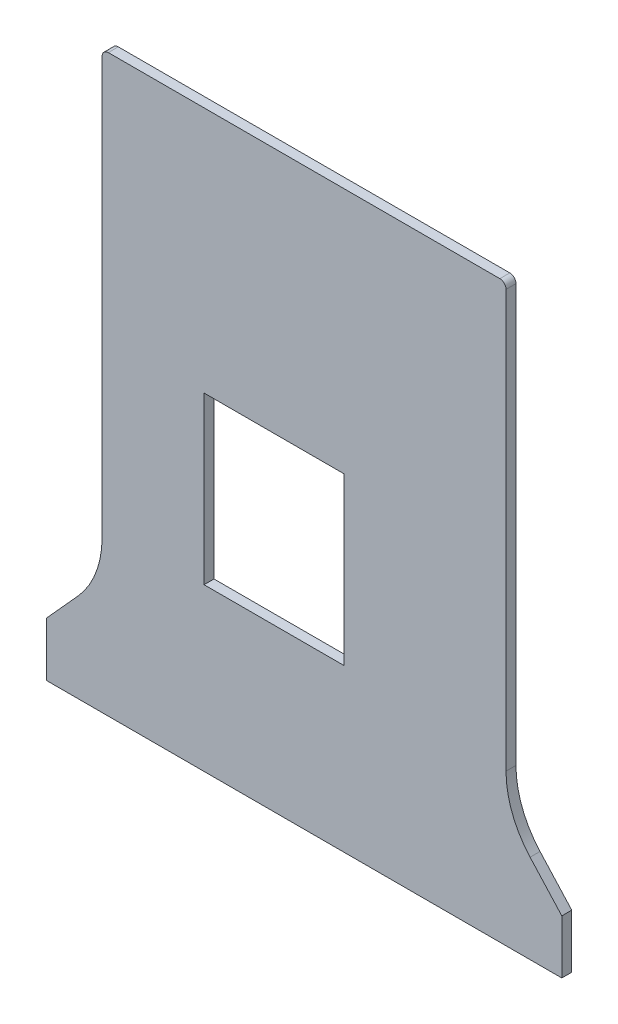
ISO-10303-21;
HEADER;
FILE_DESCRIPTION(('STEP AP214'),'2;1');
FILE_NAME('part.step','',(''),(''),'','','');
FILE_SCHEMA(('AUTOMOTIVE_DESIGN { 1 0 10303 214 1 1 1 1 }'));
ENDSEC;
DATA;
#1=APPLICATION_CONTEXT('core data for automotive mechanical design processes');
#2=APPLICATION_PROTOCOL_DEFINITION('international standard','automotive_design',2000,#1);
#3=PRODUCT_CONTEXT('',#1,'mechanical');
#4=PRODUCT('Part','Part','',(#3));
#5=PRODUCT_RELATED_PRODUCT_CATEGORY('part','',(#4));
#6=PRODUCT_DEFINITION_FORMATION('','',#4);
#7=PRODUCT_DEFINITION_CONTEXT('part definition',#1,'design');
#8=PRODUCT_DEFINITION('design','',#6,#7);
#9=PRODUCT_DEFINITION_SHAPE('','',#8);
#10=(LENGTH_UNIT() NAMED_UNIT(*) SI_UNIT(.MILLI.,.METRE.));
#11=(NAMED_UNIT(*) PLANE_ANGLE_UNIT() SI_UNIT($,.RADIAN.));
#12=(NAMED_UNIT(*) SI_UNIT($,.STERADIAN.) SOLID_ANGLE_UNIT());
#13=UNCERTAINTY_MEASURE_WITH_UNIT(LENGTH_MEASURE(1.E-05),#10,'distance_accuracy_value','');
#14=(GEOMETRIC_REPRESENTATION_CONTEXT(3) GLOBAL_UNCERTAINTY_ASSIGNED_CONTEXT((#13)) GLOBAL_UNIT_ASSIGNED_CONTEXT((#10,
#11,#12)) REPRESENTATION_CONTEXT('',''));
#15=CARTESIAN_POINT('',(0.,0.,0.));
#16=DIRECTION('',(0.,0.,1.));
#17=DIRECTION('',(1.,0.,0.));
#18=AXIS2_PLACEMENT_3D('',#15,#16,#17);
#19=CARTESIAN_POINT('',(10.2737135930498,91.5260475967509,1.6));
#20=DIRECTION('',(0.,0.,1.));
#21=DIRECTION('',(1.,0.,0.));
#22=AXIS2_PLACEMENT_3D('',#19,#20,#21);
#23=PLANE('',#22);
#24=CARTESIAN_POINT('',(10.2737135930498,91.5260475967509,1.6));
#25=DIRECTION('',(0.,0.,1.));
#26=DIRECTION('',(1.,0.,0.));
#27=AXIS2_PLACEMENT_3D('',#24,#25,#26);
#28=CIRCLE('',#27,1.00381057336768);
#29=CARTESIAN_POINT('',(10.2701473980852,92.5298518353643,1.6));
#30=VERTEX_POINT('',#29);
#31=CARTESIAN_POINT('',(9.26999999999999,91.5400007444908,1.6));
#32=VERTEX_POINT('',#31);
#33=EDGE_CURVE('E182',#30,#32,#28,.T.);
#34=ORIENTED_EDGE('',*,*,#33,.T.);
#35=DIRECTION('',(0.,-1.,0.));
#36=VECTOR('',#35,1.);
#37=CARTESIAN_POINT('',(9.26999999999999,91.5400007444908,1.6));
#38=LINE('',#37,#36);
#39=CARTESIAN_POINT('',(9.27,24.38,1.6));
#40=VERTEX_POINT('',#39);
#41=EDGE_CURVE('E185',#32,#40,#38,.T.);
#42=ORIENTED_EDGE('',*,*,#41,.T.);
#43=CARTESIAN_POINT('',(-5.76557255008635,24.4218982308294,1.6));
#44=DIRECTION('',(0.,0.,-1.));
#45=DIRECTION('',(1.,0.,0.));
#46=AXIS2_PLACEMENT_3D('',#43,#44,#45);
#47=CIRCLE('',#46,15.0356309269234);
#48=CARTESIAN_POINT('',(5.37370372042921,14.3230506956012,1.6));
#49=VERTEX_POINT('',#48);
#50=EDGE_CURVE('E188',#40,#49,#47,.T.);
#51=ORIENTED_EDGE('',*,*,#50,.T.);
#52=DIRECTION('',(-0.670705790965145,-0.741723494279249,0.));
#53=VECTOR('',#52,1.);
#54=CARTESIAN_POINT('',(0.28,8.69,1.6));
#55=LINE('',#54,#53);
#56=CARTESIAN_POINT('',(0.28,8.69,1.6));
#57=VERTEX_POINT('',#56);
#58=EDGE_CURVE('E190',#49,#57,#55,.T.);
#59=ORIENTED_EDGE('',*,*,#58,.T.);
#60=DIRECTION('',(0.,-1.,0.));
#61=VECTOR('',#60,1.);
#62=CARTESIAN_POINT('',(0.28,8.69,1.6));
#63=LINE('',#62,#61);
#64=CARTESIAN_POINT('',(0.28,0.03,1.6));
#65=VERTEX_POINT('',#64);
#66=EDGE_CURVE('E192',#57,#65,#63,.T.);
#67=ORIENTED_EDGE('',*,*,#66,.T.);
#68=DIRECTION('',(1.,0.,0.));
#69=VECTOR('',#68,1.);
#70=CARTESIAN_POINT('',(0.28,0.03,1.6));
#71=LINE('',#70,#69);
#72=CARTESIAN_POINT('',(83.2604684695915,0.03,1.6));
#73=VERTEX_POINT('',#72);
#74=EDGE_CURVE('E194',#65,#73,#71,.T.);
#75=ORIENTED_EDGE('',*,*,#74,.T.);
#76=DIRECTION('',(0.,1.,0.));
#77=VECTOR('',#76,1.);
#78=CARTESIAN_POINT('',(83.2604684695915,8.69,1.6));
#79=LINE('',#78,#77);
#80=CARTESIAN_POINT('',(83.2604684695915,8.69,1.6));
#81=VERTEX_POINT('',#80);
#82=EDGE_CURVE('E196',#73,#81,#79,.T.);
#83=ORIENTED_EDGE('',*,*,#82,.T.);
#84=DIRECTION('',(-0.671848331989014,0.740688746237972,0.));
#85=VECTOR('',#84,1.);
#86=CARTESIAN_POINT('',(78.1580876726521,14.3151922574923,1.6));
#87=LINE('',#86,#85);
#88=CARTESIAN_POINT('',(78.1580876726521,14.3151922574923,1.6));
#89=VERTEX_POINT('',#88);
#90=EDGE_CURVE('E198',#81,#89,#87,.T.);
#91=ORIENTED_EDGE('',*,*,#90,.T.);
#92=CARTESIAN_POINT('',(89.3157593931351,24.3937119478333,1.6));
#93=DIRECTION('',(0.,0.,-1.));
#94=DIRECTION('',(1.,0.,0.));
#95=AXIS2_PLACEMENT_3D('',#92,#93,#94);
#96=CIRCLE('',#95,15.0356309269234);
#97=CARTESIAN_POINT('',(74.2801473980851,24.3698518353643,1.6));
#98=VERTEX_POINT('',#97);
#99=EDGE_CURVE('E200',#89,#98,#96,.T.);
#100=ORIENTED_EDGE('',*,*,#99,.T.);
#101=DIRECTION('',(0.,1.,0.));
#102=VECTOR('',#101,1.);
#103=CARTESIAN_POINT('',(74.2801473980851,91.5298518353643,1.6));
#104=LINE('',#103,#102);
#105=CARTESIAN_POINT('',(74.2801473980851,91.5298518353643,1.6));
#106=VERTEX_POINT('',#105);
#107=EDGE_CURVE('E202',#98,#106,#104,.T.);
#108=ORIENTED_EDGE('',*,*,#107,.T.);
#109=CARTESIAN_POINT('',(73.2763437015991,91.5261361758431,1.6));
#110=DIRECTION('',(0.,0.,1.));
#111=DIRECTION('',(1.,0.,0.));
#112=AXIS2_PLACEMENT_3D('',#109,#110,#111);
#113=CIRCLE('',#112,1.00381057336769);
#114=CARTESIAN_POINT('',(73.2901473980852,92.5298518353643,1.6));
#115=VERTEX_POINT('',#114);
#116=EDGE_CURVE('E204',#106,#115,#113,.T.);
#117=ORIENTED_EDGE('',*,*,#116,.T.);
#118=DIRECTION('',(-1.,0.,0.));
#119=VECTOR('',#118,1.);
#120=CARTESIAN_POINT('',(73.2901473980852,92.5298518353643,1.6));
#121=LINE('',#120,#119);
#122=EDGE_CURVE('E206',#115,#30,#121,.T.);
#123=ORIENTED_EDGE('',*,*,#122,.T.);
#124=EDGE_LOOP('',(#34,#42,#51,#59,#67,#75,#83,#91,#100,#108,#117,#123));
#125=FACE_BOUND('',#124,.T.);
#126=DIRECTION('',(1.,0.,0.));
#127=VECTOR('',#126,1.);
#128=CARTESIAN_POINT('',(48.18,26.06,1.6));
#129=LINE('',#128,#127);
#130=CARTESIAN_POINT('',(25.68,26.06,1.6));
#131=VERTEX_POINT('',#130);
#132=CARTESIAN_POINT('',(48.18,26.06,1.6));
#133=VERTEX_POINT('',#132);
#134=EDGE_CURVE('E154',#131,#133,#129,.T.);
#135=ORIENTED_EDGE('',*,*,#134,.F.);
#136=DIRECTION('',(0.,-1.,0.));
#137=VECTOR('',#136,1.);
#138=CARTESIAN_POINT('',(25.68,26.06,1.6));
#139=LINE('',#138,#137);
#140=CARTESIAN_POINT('',(25.68,52.78,1.6));
#141=VERTEX_POINT('',#140);
#142=EDGE_CURVE('E146',#141,#131,#139,.T.);
#143=ORIENTED_EDGE('',*,*,#142,.F.);
#144=DIRECTION('',(-1.,0.,0.));
#145=VECTOR('',#144,1.);
#146=CARTESIAN_POINT('',(25.68,52.78,1.6));
#147=LINE('',#146,#145);
#148=CARTESIAN_POINT('',(48.18,52.78,1.6));
#149=VERTEX_POINT('',#148);
#150=EDGE_CURVE('E168',#149,#141,#147,.T.);
#151=ORIENTED_EDGE('',*,*,#150,.F.);
#152=DIRECTION('',(0.,1.,0.));
#153=VECTOR('',#152,1.);
#154=CARTESIAN_POINT('',(48.18,52.78,1.6));
#155=LINE('',#154,#153);
#156=EDGE_CURVE('E166',#133,#149,#155,.T.);
#157=ORIENTED_EDGE('',*,*,#156,.F.);
#158=EDGE_LOOP('',(#135,#143,#151,#157));
#159=FACE_BOUND('',#158,.T.);
#160=ADVANCED_FACE('F33',(#125,#159),#23,.T.);
#161=CARTESIAN_POINT('',(10.2737135930498,91.5260475967509,0.));
#162=DIRECTION('',(0.,0.,1.));
#163=DIRECTION('',(1.,0.,0.));
#164=AXIS2_PLACEMENT_3D('',#161,#162,#163);
#165=PLANE('',#164);
#166=CARTESIAN_POINT('',(10.2737135930498,91.5260475967509,0.));
#167=DIRECTION('',(0.,0.,1.));
#168=DIRECTION('',(1.,0.,0.));
#169=AXIS2_PLACEMENT_3D('',#166,#167,#168);
#170=CIRCLE('',#169,1.00381057336768);
#171=CARTESIAN_POINT('',(10.2701473980852,92.5298518353643,0.));
#172=VERTEX_POINT('',#171);
#173=CARTESIAN_POINT('',(9.26999999999999,91.5400007444908,0.));
#174=VERTEX_POINT('',#173);
#175=EDGE_CURVE('E162',#172,#174,#170,.T.);
#176=ORIENTED_EDGE('',*,*,#175,.F.);
#177=DIRECTION('',(-1.,0.,0.));
#178=VECTOR('',#177,1.);
#179=CARTESIAN_POINT('',(73.2901473980852,92.5298518353643,0.));
#180=LINE('',#179,#178);
#181=CARTESIAN_POINT('',(73.2901473980852,92.5298518353643,0.));
#182=VERTEX_POINT('',#181);
#183=EDGE_CURVE('E186',#182,#172,#180,.T.);
#184=ORIENTED_EDGE('',*,*,#183,.F.);
#185=CARTESIAN_POINT('',(73.2763437015991,91.5261361758431,0.));
#186=DIRECTION('',(0.,0.,1.));
#187=DIRECTION('',(1.,0.,0.));
#188=AXIS2_PLACEMENT_3D('',#185,#186,#187);
#189=CIRCLE('',#188,1.00381057336769);
#190=CARTESIAN_POINT('',(74.2801473980851,91.5298518353643,0.));
#191=VERTEX_POINT('',#190);
#192=EDGE_CURVE('E229',#191,#182,#189,.T.);
#193=ORIENTED_EDGE('',*,*,#192,.F.);
#194=DIRECTION('',(0.,1.,0.));
#195=VECTOR('',#194,1.);
#196=CARTESIAN_POINT('',(74.2801473980851,91.5298518353643,0.));
#197=LINE('',#196,#195);
#198=CARTESIAN_POINT('',(74.2801473980851,24.3698518353643,0.));
#199=VERTEX_POINT('',#198);
#200=EDGE_CURVE('E227',#199,#191,#197,.T.);
#201=ORIENTED_EDGE('',*,*,#200,.F.);
#202=CARTESIAN_POINT('',(89.3157593931351,24.3937119478333,0.));
#203=DIRECTION('',(0.,0.,-1.));
#204=DIRECTION('',(1.,0.,0.));
#205=AXIS2_PLACEMENT_3D('',#202,#203,#204);
#206=CIRCLE('',#205,15.0356309269234);
#207=CARTESIAN_POINT('',(78.1580876726521,14.3151922574923,0.));
#208=VERTEX_POINT('',#207);
#209=EDGE_CURVE('E225',#208,#199,#206,.T.);
#210=ORIENTED_EDGE('',*,*,#209,.F.);
#211=DIRECTION('',(-0.671848331989014,0.740688746237972,0.));
#212=VECTOR('',#211,1.);
#213=CARTESIAN_POINT('',(78.1580876726521,14.3151922574923,0.));
#214=LINE('',#213,#212);
#215=CARTESIAN_POINT('',(83.2604684695915,8.69,0.));
#216=VERTEX_POINT('',#215);
#217=EDGE_CURVE('E223',#216,#208,#214,.T.);
#218=ORIENTED_EDGE('',*,*,#217,.F.);
#219=DIRECTION('',(0.,1.,0.));
#220=VECTOR('',#219,1.);
#221=CARTESIAN_POINT('',(83.2604684695915,8.69,0.));
#222=LINE('',#221,#220);
#223=CARTESIAN_POINT('',(83.2604684695915,0.03,0.));
#224=VERTEX_POINT('',#223);
#225=EDGE_CURVE('E221',#224,#216,#222,.T.);
#226=ORIENTED_EDGE('',*,*,#225,.F.);
#227=DIRECTION('',(1.,0.,0.));
#228=VECTOR('',#227,1.);
#229=CARTESIAN_POINT('',(0.28,0.03,0.));
#230=LINE('',#229,#228);
#231=CARTESIAN_POINT('',(0.28,0.03,0.));
#232=VERTEX_POINT('',#231);
#233=EDGE_CURVE('E219',#232,#224,#230,.T.);
#234=ORIENTED_EDGE('',*,*,#233,.F.);
#235=DIRECTION('',(0.,-1.,0.));
#236=VECTOR('',#235,1.);
#237=CARTESIAN_POINT('',(0.28,8.69,0.));
#238=LINE('',#237,#236);
#239=CARTESIAN_POINT('',(0.28,8.69,0.));
#240=VERTEX_POINT('',#239);
#241=EDGE_CURVE('E217',#240,#232,#238,.T.);
#242=ORIENTED_EDGE('',*,*,#241,.F.);
#243=DIRECTION('',(-0.670705790965145,-0.741723494279249,0.));
#244=VECTOR('',#243,1.);
#245=CARTESIAN_POINT('',(0.28,8.69,0.));
#246=LINE('',#245,#244);
#247=CARTESIAN_POINT('',(5.37370372042921,14.3230506956012,0.));
#248=VERTEX_POINT('',#247);
#249=EDGE_CURVE('E215',#248,#240,#246,.T.);
#250=ORIENTED_EDGE('',*,*,#249,.F.);
#251=CARTESIAN_POINT('',(-5.76557255008635,24.4218982308294,0.));
#252=DIRECTION('',(0.,0.,-1.));
#253=DIRECTION('',(1.,0.,0.));
#254=AXIS2_PLACEMENT_3D('',#251,#252,#253);
#255=CIRCLE('',#254,15.0356309269234);
#256=CARTESIAN_POINT('',(9.27,24.38,0.));
#257=VERTEX_POINT('',#256);
#258=EDGE_CURVE('E213',#257,#248,#255,.T.);
#259=ORIENTED_EDGE('',*,*,#258,.F.);
#260=DIRECTION('',(0.,-1.,0.));
#261=VECTOR('',#260,1.);
#262=CARTESIAN_POINT('',(9.26999999999999,91.5400007444908,0.));
#263=LINE('',#262,#261);
#264=EDGE_CURVE('E211',#174,#257,#263,.T.);
#265=ORIENTED_EDGE('',*,*,#264,.F.);
#266=EDGE_LOOP('',(#176,#184,#193,#201,#210,#218,#226,#234,#242,#250,#259,#265));
#267=FACE_BOUND('',#266,.T.);
#268=DIRECTION('',(0.,-1.,0.));
#269=VECTOR('',#268,1.);
#270=CARTESIAN_POINT('',(25.68,26.06,0.));
#271=LINE('',#270,#269);
#272=CARTESIAN_POINT('',(25.68,52.78,0.));
#273=VERTEX_POINT('',#272);
#274=CARTESIAN_POINT('',(25.68,26.06,0.));
#275=VERTEX_POINT('',#274);
#276=EDGE_CURVE('E56',#273,#275,#271,.T.);
#277=ORIENTED_EDGE('',*,*,#276,.T.);
#278=DIRECTION('',(1.,0.,0.));
#279=VECTOR('',#278,1.);
#280=CARTESIAN_POINT('',(48.18,26.06,0.));
#281=LINE('',#280,#279);
#282=CARTESIAN_POINT('',(48.18,26.06,0.));
#283=VERTEX_POINT('',#282);
#284=EDGE_CURVE('E161',#275,#283,#281,.T.);
#285=ORIENTED_EDGE('',*,*,#284,.T.);
#286=DIRECTION('',(0.,1.,0.));
#287=VECTOR('',#286,1.);
#288=CARTESIAN_POINT('',(48.18,52.78,0.));
#289=LINE('',#288,#287);
#290=CARTESIAN_POINT('',(48.18,52.78,0.));
#291=VERTEX_POINT('',#290);
#292=EDGE_CURVE('E174',#283,#291,#289,.T.);
#293=ORIENTED_EDGE('',*,*,#292,.T.);
#294=DIRECTION('',(-1.,0.,0.));
#295=VECTOR('',#294,1.);
#296=CARTESIAN_POINT('',(25.68,52.78,0.));
#297=LINE('',#296,#295);
#298=EDGE_CURVE('E155',#291,#273,#297,.T.);
#299=ORIENTED_EDGE('',*,*,#298,.T.);
#300=EDGE_LOOP('',(#277,#285,#293,#299));
#301=FACE_BOUND('',#300,.T.);
#302=ADVANCED_FACE('F271',(#267,#301),#165,.F.);
#303=CARTESIAN_POINT('',(10.2737135930498,91.5260475967509,1.6));
#304=DIRECTION('',(0.,0.,-1.));
#305=DIRECTION('',(-1.,0.,0.));
#306=AXIS2_PLACEMENT_3D('',#303,#304,#305);
#307=CYLINDRICAL_SURFACE('',#306,1.00381057336768);
#308=ORIENTED_EDGE('',*,*,#175,.T.);
#309=DIRECTION('',(0.,0.,-1.));
#310=VECTOR('',#309,1.);
#311=CARTESIAN_POINT('',(9.26999999999999,91.5400007444908,1.6));
#312=LINE('',#311,#310);
#313=EDGE_CURVE('E11',#32,#174,#312,.T.);
#314=ORIENTED_EDGE('',*,*,#313,.F.);
#315=ORIENTED_EDGE('',*,*,#33,.F.);
#316=DIRECTION('',(0.,0.,-1.));
#317=VECTOR('',#316,1.);
#318=CARTESIAN_POINT('',(10.2701473980852,92.5298518353643,1.6));
#319=LINE('',#318,#317);
#320=EDGE_CURVE('E208',#30,#172,#319,.T.);
#321=ORIENTED_EDGE('',*,*,#320,.T.);
#322=EDGE_LOOP('',(#308,#314,#315,#321));
#323=FACE_BOUND('',#322,.T.);
#324=ADVANCED_FACE('F35',(#323),#307,.T.);
#325=CARTESIAN_POINT('',(9.26999999999999,91.5400007444908,1.6));
#326=DIRECTION('',(1.,0.,0.));
#327=DIRECTION('',(0.,1.,0.));
#328=AXIS2_PLACEMENT_3D('',#325,#326,#327);
#329=PLANE('',#328);
#330=ORIENTED_EDGE('',*,*,#264,.T.);
#331=DIRECTION('',(0.,0.,-1.));
#332=VECTOR('',#331,1.);
#333=CARTESIAN_POINT('',(9.27,24.38,1.6));
#334=LINE('',#333,#332);
#335=EDGE_CURVE('E41',#40,#257,#334,.T.);
#336=ORIENTED_EDGE('',*,*,#335,.F.);
#337=ORIENTED_EDGE('',*,*,#41,.F.);
#338=ORIENTED_EDGE('',*,*,#313,.T.);
#339=EDGE_LOOP('',(#330,#336,#337,#338));
#340=FACE_BOUND('',#339,.T.);
#341=ADVANCED_FACE('F288',(#340),#329,.F.);
#342=CARTESIAN_POINT('',(-5.76557255008635,24.4218982308294,1.6));
#343=DIRECTION('',(0.,0.,-1.));
#344=DIRECTION('',(-1.,0.,0.));
#345=AXIS2_PLACEMENT_3D('',#342,#343,#344);
#346=CYLINDRICAL_SURFACE('',#345,15.0356309269234);
#347=ORIENTED_EDGE('',*,*,#258,.T.);
#348=DIRECTION('',(0.,0.,-1.));
#349=VECTOR('',#348,1.);
#350=CARTESIAN_POINT('',(5.37370372042921,14.3230506956012,1.6));
#351=LINE('',#350,#349);
#352=EDGE_CURVE('E258',#49,#248,#351,.T.);
#353=ORIENTED_EDGE('',*,*,#352,.F.);
#354=ORIENTED_EDGE('',*,*,#50,.F.);
#355=ORIENTED_EDGE('',*,*,#335,.T.);
#356=EDGE_LOOP('',(#347,#353,#354,#355));
#357=FACE_BOUND('',#356,.T.);
#358=ADVANCED_FACE('F265',(#357),#346,.F.);
#359=CARTESIAN_POINT('',(0.28,8.69,1.6));
#360=DIRECTION('',(0.741723494279249,-0.670705790965145,0.));
#361=DIRECTION('',(0.670705790965145,0.741723494279249,0.));
#362=AXIS2_PLACEMENT_3D('',#359,#360,#361);
#363=PLANE('',#362);
#364=ORIENTED_EDGE('',*,*,#249,.T.);
#365=DIRECTION('',(0.,0.,-1.));
#366=VECTOR('',#365,1.);
#367=CARTESIAN_POINT('',(0.28,8.69,1.6));
#368=LINE('',#367,#366);
#369=EDGE_CURVE('E255',#57,#240,#368,.T.);
#370=ORIENTED_EDGE('',*,*,#369,.F.);
#371=ORIENTED_EDGE('',*,*,#58,.F.);
#372=ORIENTED_EDGE('',*,*,#352,.T.);
#373=EDGE_LOOP('',(#364,#370,#371,#372));
#374=FACE_BOUND('',#373,.T.);
#375=ADVANCED_FACE('F277',(#374),#363,.F.);
#376=CARTESIAN_POINT('',(0.28,8.69,1.6));
#377=DIRECTION('',(1.,0.,0.));
#378=DIRECTION('',(0.,0.,-1.));
#379=AXIS2_PLACEMENT_3D('',#376,#377,#378);
#380=PLANE('',#379);
#381=ORIENTED_EDGE('',*,*,#241,.T.);
#382=DIRECTION('',(0.,0.,-1.));
#383=VECTOR('',#382,1.);
#384=CARTESIAN_POINT('',(0.28,0.03,1.6));
#385=LINE('',#384,#383);
#386=EDGE_CURVE('E252',#65,#232,#385,.T.);
#387=ORIENTED_EDGE('',*,*,#386,.F.);
#388=ORIENTED_EDGE('',*,*,#66,.F.);
#389=ORIENTED_EDGE('',*,*,#369,.T.);
#390=EDGE_LOOP('',(#381,#387,#388,#389));
#391=FACE_BOUND('',#390,.T.);
#392=ADVANCED_FACE('F281',(#391),#380,.F.);
#393=CARTESIAN_POINT('',(0.28,0.03,1.6));
#394=DIRECTION('',(0.,1.,0.));
#395=DIRECTION('',(0.,0.,1.));
#396=AXIS2_PLACEMENT_3D('',#393,#394,#395);
#397=PLANE('',#396);
#398=ORIENTED_EDGE('',*,*,#233,.T.);
#399=DIRECTION('',(0.,0.,-1.));
#400=VECTOR('',#399,1.);
#401=CARTESIAN_POINT('',(83.2604684695915,0.03,1.6));
#402=LINE('',#401,#400);
#403=EDGE_CURVE('E249',#73,#224,#402,.T.);
#404=ORIENTED_EDGE('',*,*,#403,.F.);
#405=ORIENTED_EDGE('',*,*,#74,.F.);
#406=ORIENTED_EDGE('',*,*,#386,.T.);
#407=EDGE_LOOP('',(#398,#404,#405,#406));
#408=FACE_BOUND('',#407,.T.);
#409=ADVANCED_FACE('F321',(#408),#397,.F.);
#410=CARTESIAN_POINT('',(83.2604684695915,8.69,1.6));
#411=DIRECTION('',(-1.,0.,0.));
#412=DIRECTION('',(0.,0.,1.));
#413=AXIS2_PLACEMENT_3D('',#410,#411,#412);
#414=PLANE('',#413);
#415=ORIENTED_EDGE('',*,*,#225,.T.);
#416=DIRECTION('',(0.,0.,-1.));
#417=VECTOR('',#416,1.);
#418=CARTESIAN_POINT('',(83.2604684695915,8.69,1.6));
#419=LINE('',#418,#417);
#420=EDGE_CURVE('E246',#81,#216,#419,.T.);
#421=ORIENTED_EDGE('',*,*,#420,.F.);
#422=ORIENTED_EDGE('',*,*,#82,.F.);
#423=ORIENTED_EDGE('',*,*,#403,.T.);
#424=EDGE_LOOP('',(#415,#421,#422,#423));
#425=FACE_BOUND('',#424,.T.);
#426=ADVANCED_FACE('F319',(#425),#414,.F.);
#427=CARTESIAN_POINT('',(78.1580876726521,14.3151922574923,1.6));
#428=DIRECTION('',(-0.740688746237972,-0.671848331989015,0.));
#429=DIRECTION('',(0.671848331989015,-0.740688746237972,0.));
#430=AXIS2_PLACEMENT_3D('',#427,#428,#429);
#431=PLANE('',#430);
#432=ORIENTED_EDGE('',*,*,#217,.T.);
#433=DIRECTION('',(0.,0.,-1.));
#434=VECTOR('',#433,1.);
#435=CARTESIAN_POINT('',(78.1580876726521,14.3151922574923,1.6));
#436=LINE('',#435,#434);
#437=EDGE_CURVE('E243',#89,#208,#436,.T.);
#438=ORIENTED_EDGE('',*,*,#437,.F.);
#439=ORIENTED_EDGE('',*,*,#90,.F.);
#440=ORIENTED_EDGE('',*,*,#420,.T.);
#441=EDGE_LOOP('',(#432,#438,#439,#440));
#442=FACE_BOUND('',#441,.T.);
#443=ADVANCED_FACE('F315',(#442),#431,.F.);
#444=CARTESIAN_POINT('',(89.3157593931351,24.3937119478333,1.6));
#445=DIRECTION('',(0.,0.,-1.));
#446=DIRECTION('',(-1.,0.,0.));
#447=AXIS2_PLACEMENT_3D('',#444,#445,#446);
#448=CYLINDRICAL_SURFACE('',#447,15.0356309269234);
#449=ORIENTED_EDGE('',*,*,#209,.T.);
#450=DIRECTION('',(0.,0.,-1.));
#451=VECTOR('',#450,1.);
#452=CARTESIAN_POINT('',(74.2801473980851,24.3698518353643,1.6));
#453=LINE('',#452,#451);
#454=EDGE_CURVE('E240',#98,#199,#453,.T.);
#455=ORIENTED_EDGE('',*,*,#454,.F.);
#456=ORIENTED_EDGE('',*,*,#99,.F.);
#457=ORIENTED_EDGE('',*,*,#437,.T.);
#458=EDGE_LOOP('',(#449,#455,#456,#457));
#459=FACE_BOUND('',#458,.T.);
#460=ADVANCED_FACE('F310',(#459),#448,.F.);
#461=CARTESIAN_POINT('',(74.2801473980851,91.5298518353643,1.6));
#462=DIRECTION('',(-1.,0.,0.));
#463=DIRECTION('',(0.,0.,1.));
#464=AXIS2_PLACEMENT_3D('',#461,#462,#463);
#465=PLANE('',#464);
#466=ORIENTED_EDGE('',*,*,#200,.T.);
#467=DIRECTION('',(0.,0.,-1.));
#468=VECTOR('',#467,1.);
#469=CARTESIAN_POINT('',(74.2801473980851,91.5298518353643,1.6));
#470=LINE('',#469,#468);
#471=EDGE_CURVE('E237',#106,#191,#470,.T.);
#472=ORIENTED_EDGE('',*,*,#471,.F.);
#473=ORIENTED_EDGE('',*,*,#107,.F.);
#474=ORIENTED_EDGE('',*,*,#454,.T.);
#475=EDGE_LOOP('',(#466,#472,#473,#474));
#476=FACE_BOUND('',#475,.T.);
#477=ADVANCED_FACE('F304',(#476),#465,.F.);
#478=CARTESIAN_POINT('',(73.2763437015991,91.5261361758431,1.6));
#479=DIRECTION('',(0.,0.,-1.));
#480=DIRECTION('',(-1.,0.,0.));
#481=AXIS2_PLACEMENT_3D('',#478,#479,#480);
#482=CYLINDRICAL_SURFACE('',#481,1.00381057336769);
#483=ORIENTED_EDGE('',*,*,#192,.T.);
#484=DIRECTION('',(0.,0.,-1.));
#485=VECTOR('',#484,1.);
#486=CARTESIAN_POINT('',(73.2901473980852,92.5298518353643,1.6));
#487=LINE('',#486,#485);
#488=EDGE_CURVE('E234',#115,#182,#487,.T.);
#489=ORIENTED_EDGE('',*,*,#488,.F.);
#490=ORIENTED_EDGE('',*,*,#116,.F.);
#491=ORIENTED_EDGE('',*,*,#471,.T.);
#492=EDGE_LOOP('',(#483,#489,#490,#491));
#493=FACE_BOUND('',#492,.T.);
#494=ADVANCED_FACE('F300',(#493),#482,.T.);
#495=CARTESIAN_POINT('',(73.2901473980852,92.5298518353643,1.6));
#496=DIRECTION('',(0.,-1.,0.));
#497=DIRECTION('',(1.,0.,0.));
#498=AXIS2_PLACEMENT_3D('',#495,#496,#497);
#499=PLANE('',#498);
#500=ORIENTED_EDGE('',*,*,#183,.T.);
#501=ORIENTED_EDGE('',*,*,#320,.F.);
#502=ORIENTED_EDGE('',*,*,#122,.F.);
#503=ORIENTED_EDGE('',*,*,#488,.T.);
#504=EDGE_LOOP('',(#500,#501,#502,#503));
#505=FACE_BOUND('',#504,.T.);
#506=ADVANCED_FACE('F295',(#505),#499,.F.);
#507=CARTESIAN_POINT('',(25.68,26.06,1.6));
#508=DIRECTION('',(1.,0.,0.));
#509=DIRECTION('',(0.,0.,-1.));
#510=AXIS2_PLACEMENT_3D('',#507,#508,#509);
#511=PLANE('',#510);
#512=ORIENTED_EDGE('',*,*,#276,.F.);
#513=DIRECTION('',(0.,0.,-1.));
#514=VECTOR('',#513,1.);
#515=CARTESIAN_POINT('',(25.68,52.78,1.6));
#516=LINE('',#515,#514);
#517=EDGE_CURVE('E150',#141,#273,#516,.T.);
#518=ORIENTED_EDGE('',*,*,#517,.F.);
#519=ORIENTED_EDGE('',*,*,#142,.T.);
#520=DIRECTION('',(0.,0.,-1.));
#521=VECTOR('',#520,1.);
#522=CARTESIAN_POINT('',(25.68,26.06,1.6));
#523=LINE('',#522,#521);
#524=EDGE_CURVE('E149',#131,#275,#523,.T.);
#525=ORIENTED_EDGE('',*,*,#524,.T.);
#526=EDGE_LOOP('',(#512,#518,#519,#525));
#527=FACE_BOUND('',#526,.T.);
#528=ADVANCED_FACE('F148',(#527),#511,.T.);
#529=CARTESIAN_POINT('',(48.18,26.06,1.6));
#530=DIRECTION('',(0.,1.,0.));
#531=DIRECTION('',(0.,0.,1.));
#532=AXIS2_PLACEMENT_3D('',#529,#530,#531);
#533=PLANE('',#532);
#534=ORIENTED_EDGE('',*,*,#284,.F.);
#535=ORIENTED_EDGE('',*,*,#524,.F.);
#536=ORIENTED_EDGE('',*,*,#134,.T.);
#537=DIRECTION('',(0.,0.,-1.));
#538=VECTOR('',#537,1.);
#539=CARTESIAN_POINT('',(48.18,26.06,1.6));
#540=LINE('',#539,#538);
#541=EDGE_CURVE('E163',#133,#283,#540,.T.);
#542=ORIENTED_EDGE('',*,*,#541,.T.);
#543=EDGE_LOOP('',(#534,#535,#536,#542));
#544=FACE_BOUND('',#543,.T.);
#545=ADVANCED_FACE('F158',(#544),#533,.T.);
#546=CARTESIAN_POINT('',(48.18,52.78,1.6));
#547=DIRECTION('',(-1.,0.,0.));
#548=DIRECTION('',(0.,0.,1.));
#549=AXIS2_PLACEMENT_3D('',#546,#547,#548);
#550=PLANE('',#549);
#551=ORIENTED_EDGE('',*,*,#292,.F.);
#552=ORIENTED_EDGE('',*,*,#541,.F.);
#553=ORIENTED_EDGE('',*,*,#156,.T.);
#554=DIRECTION('',(0.,0.,-1.));
#555=VECTOR('',#554,1.);
#556=CARTESIAN_POINT('',(48.18,52.78,1.6));
#557=LINE('',#556,#555);
#558=EDGE_CURVE('E48',#149,#291,#557,.T.);
#559=ORIENTED_EDGE('',*,*,#558,.T.);
#560=EDGE_LOOP('',(#551,#552,#553,#559));
#561=FACE_BOUND('',#560,.T.);
#562=ADVANCED_FACE('F379',(#561),#550,.T.);
#563=CARTESIAN_POINT('',(25.68,52.78,1.6));
#564=DIRECTION('',(0.,-1.,0.));
#565=DIRECTION('',(0.,0.,-1.));
#566=AXIS2_PLACEMENT_3D('',#563,#564,#565);
#567=PLANE('',#566);
#568=ORIENTED_EDGE('',*,*,#298,.F.);
#569=ORIENTED_EDGE('',*,*,#558,.F.);
#570=ORIENTED_EDGE('',*,*,#150,.T.);
#571=ORIENTED_EDGE('',*,*,#517,.T.);
#572=EDGE_LOOP('',(#568,#569,#570,#571));
#573=FACE_BOUND('',#572,.T.);
#574=ADVANCED_FACE('F385',(#573),#567,.T.);
#575=CLOSED_SHELL('',(#160,#302,#324,#341,#358,#375,#392,#409,#426,#443,#460,#477,#494,#506,
#528,#545,#562,#574));
#576=MANIFOLD_SOLID_BREP('B2',#575);
#577=ADVANCED_BREP_SHAPE_REPRESENTATION('',(#18,#576),#14);
#578=SHAPE_DEFINITION_REPRESENTATION(#9,#577);
ENDSEC;
END-ISO-10303-21;
